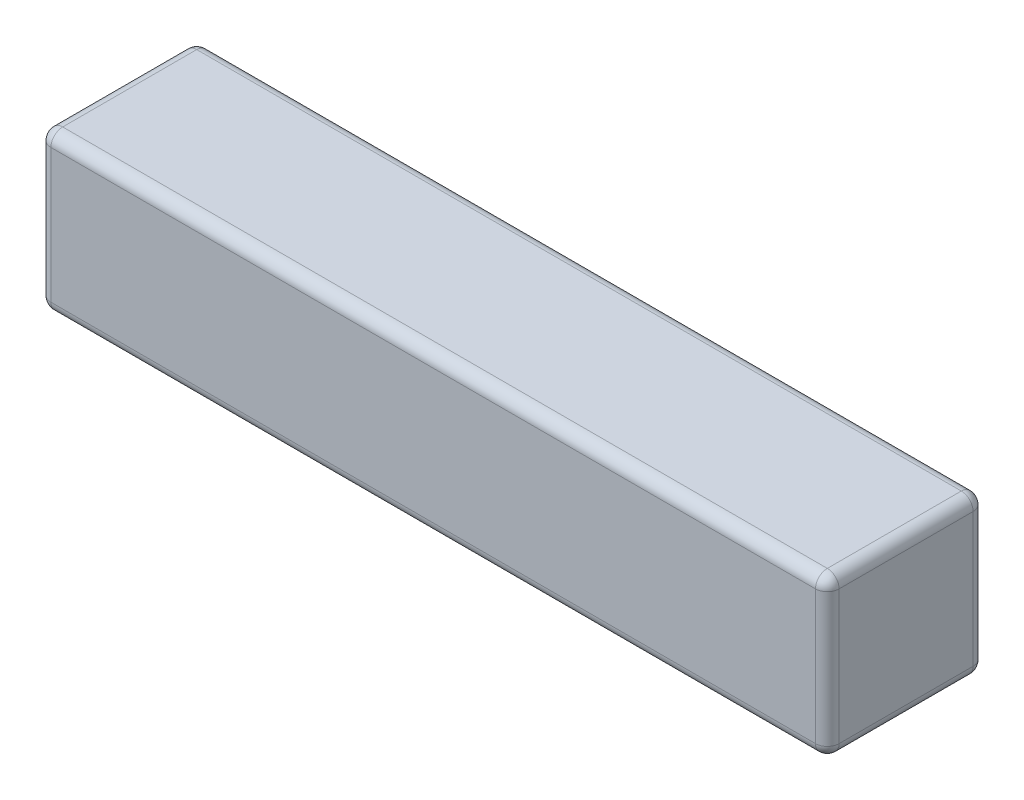
ISO-10303-21;
HEADER;
FILE_DESCRIPTION(('STEP AP214'),'2;1');
FILE_NAME('part.step','',(''),(''),'','','');
FILE_SCHEMA(('AUTOMOTIVE_DESIGN { 1 0 10303 214 1 1 1 1 }'));
ENDSEC;
DATA;
#1=APPLICATION_CONTEXT('core data for automotive mechanical design processes');
#2=APPLICATION_PROTOCOL_DEFINITION('international standard','automotive_design',2000,#1);
#3=PRODUCT_CONTEXT('',#1,'mechanical');
#4=PRODUCT('Part','Part','',(#3));
#5=PRODUCT_RELATED_PRODUCT_CATEGORY('part','',(#4));
#6=PRODUCT_DEFINITION_FORMATION('','',#4);
#7=PRODUCT_DEFINITION_CONTEXT('part definition',#1,'design');
#8=PRODUCT_DEFINITION('design','',#6,#7);
#9=PRODUCT_DEFINITION_SHAPE('','',#8);
#10=(LENGTH_UNIT() NAMED_UNIT(*) SI_UNIT(.MILLI.,.METRE.));
#11=(NAMED_UNIT(*) PLANE_ANGLE_UNIT() SI_UNIT($,.RADIAN.));
#12=(NAMED_UNIT(*) SI_UNIT($,.STERADIAN.) SOLID_ANGLE_UNIT());
#13=UNCERTAINTY_MEASURE_WITH_UNIT(LENGTH_MEASURE(1.E-05),#10,'distance_accuracy_value','');
#14=(GEOMETRIC_REPRESENTATION_CONTEXT(3) GLOBAL_UNCERTAINTY_ASSIGNED_CONTEXT((#13)) GLOBAL_UNIT_ASSIGNED_CONTEXT((#10,
#11,#12)) REPRESENTATION_CONTEXT('',''));
#15=CARTESIAN_POINT('',(0.,0.,0.));
#16=DIRECTION('',(0.,0.,1.));
#17=DIRECTION('',(1.,0.,0.));
#18=AXIS2_PLACEMENT_3D('',#15,#16,#17);
#19=CARTESIAN_POINT('',(4.,-0.15,-3.25423963133641));
#20=DIRECTION('',(-1.,0.,0.));
#21=DIRECTION('',(0.,0.,1.));
#22=AXIS2_PLACEMENT_3D('',#19,#20,#21);
#23=CYLINDRICAL_SURFACE('',#22,0.15);
#24=CARTESIAN_POINT('',(13.85,-0.15,-3.25423963133641));
#25=DIRECTION('',(-1.,0.,0.));
#26=DIRECTION('',(0.,0.,-1.));
#27=AXIS2_PLACEMENT_3D('',#24,#25,#26);
#28=CIRCLE('',#27,0.15);
#29=CARTESIAN_POINT('',(13.85,0.,-3.25423963133641));
#30=VERTEX_POINT('',#29);
#31=CARTESIAN_POINT('',(13.85,-0.15,-3.4042396313364));
#32=VERTEX_POINT('',#31);
#33=EDGE_CURVE('E25',#30,#32,#28,.T.);
#34=ORIENTED_EDGE('',*,*,#33,.T.);
#35=DIRECTION('',(1.,0.,0.));
#36=VECTOR('',#35,1.);
#37=CARTESIAN_POINT('',(14.,-0.15,-3.4042396313364));
#38=LINE('',#37,#36);
#39=CARTESIAN_POINT('',(4.15,-0.15,-3.4042396313364));
#40=VERTEX_POINT('',#39);
#41=EDGE_CURVE('E199',#40,#32,#38,.T.);
#42=ORIENTED_EDGE('',*,*,#41,.F.);
#43=CARTESIAN_POINT('',(4.15,-0.15,-3.25423963133641));
#44=DIRECTION('',(1.,0.,0.));
#45=DIRECTION('',(0.,0.,1.));
#46=AXIS2_PLACEMENT_3D('',#43,#44,#45);
#47=CIRCLE('',#46,0.15);
#48=CARTESIAN_POINT('',(4.15,0.,-3.25423963133641));
#49=VERTEX_POINT('',#48);
#50=EDGE_CURVE('E11',#40,#49,#47,.T.);
#51=ORIENTED_EDGE('',*,*,#50,.T.);
#52=DIRECTION('',(-1.,0.,0.));
#53=VECTOR('',#52,1.);
#54=CARTESIAN_POINT('',(4.,0.,-3.25423963133641));
#55=LINE('',#54,#53);
#56=EDGE_CURVE('E260',#30,#49,#55,.T.);
#57=ORIENTED_EDGE('',*,*,#56,.F.);
#58=EDGE_LOOP('',(#34,#42,#51,#57));
#59=FACE_BOUND('',#58,.T.);
#60=ADVANCED_FACE('F16',(#59),#23,.T.);
#61=CARTESIAN_POINT('',(4.15,-0.15,-3.25423963133641));
#62=DIRECTION('',(0.,1.,0.));
#63=DIRECTION('',(1.,0.,0.));
#64=AXIS2_PLACEMENT_3D('',#61,#62,#63);
#65=SPHERICAL_SURFACE('',#64,0.15);
#66=CARTESIAN_POINT('',(4.15,-0.15,-3.25423963133641));
#67=DIRECTION('',(0.,1.,0.));
#68=DIRECTION('',(0.,0.,1.));
#69=AXIS2_PLACEMENT_3D('',#66,#67,#68);
#70=CIRCLE('',#69,0.15);
#71=CARTESIAN_POINT('',(4.,-0.15,-3.25423963133641));
#72=VERTEX_POINT('',#71);
#73=EDGE_CURVE('E223',#40,#72,#70,.T.);
#74=ORIENTED_EDGE('',*,*,#73,.T.);
#75=CARTESIAN_POINT('',(4.15,-0.15,-3.25423963133641));
#76=DIRECTION('',(0.,0.,-1.));
#77=DIRECTION('',(-1.,0.,0.));
#78=AXIS2_PLACEMENT_3D('',#75,#76,#77);
#79=CIRCLE('',#78,0.15);
#80=EDGE_CURVE('E173',#72,#49,#79,.T.);
#81=ORIENTED_EDGE('',*,*,#80,.T.);
#82=ORIENTED_EDGE('',*,*,#50,.F.);
#83=EDGE_LOOP('',(#74,#81,#82));
#84=FACE_BOUND('',#83,.T.);
#85=ADVANCED_FACE('F18',(#84),#65,.T.);
#86=CARTESIAN_POINT('',(13.85,-0.15,-3.25423963133641));
#87=DIRECTION('',(0.,1.,0.));
#88=DIRECTION('',(1.,0.,0.));
#89=AXIS2_PLACEMENT_3D('',#86,#87,#88);
#90=SPHERICAL_SURFACE('',#89,0.15);
#91=CARTESIAN_POINT('',(13.85,-0.15,-3.25423963133641));
#92=DIRECTION('',(0.,0.,-1.));
#93=DIRECTION('',(-1.,0.,0.));
#94=AXIS2_PLACEMENT_3D('',#91,#92,#93);
#95=CIRCLE('',#94,0.15);
#96=CARTESIAN_POINT('',(14.,-0.15,-3.25423963133641));
#97=VERTEX_POINT('',#96);
#98=EDGE_CURVE('E193',#30,#97,#95,.T.);
#99=ORIENTED_EDGE('',*,*,#98,.T.);
#100=CARTESIAN_POINT('',(13.85,-0.15,-3.25423963133641));
#101=DIRECTION('',(0.,1.,0.));
#102=DIRECTION('',(0.,0.,1.));
#103=AXIS2_PLACEMENT_3D('',#100,#101,#102);
#104=CIRCLE('',#103,0.15);
#105=EDGE_CURVE('E190',#97,#32,#104,.T.);
#106=ORIENTED_EDGE('',*,*,#105,.T.);
#107=ORIENTED_EDGE('',*,*,#33,.F.);
#108=EDGE_LOOP('',(#99,#106,#107));
#109=FACE_BOUND('',#108,.T.);
#110=ADVANCED_FACE('F331',(#109),#90,.T.);
#111=CARTESIAN_POINT('',(4.15,-2.,-3.25423963133641));
#112=DIRECTION('',(0.,1.,0.));
#113=DIRECTION('',(0.,0.,1.));
#114=AXIS2_PLACEMENT_3D('',#111,#112,#113);
#115=CYLINDRICAL_SURFACE('',#114,0.15);
#116=CARTESIAN_POINT('',(4.15,-1.85,-3.25423963133641));
#117=DIRECTION('',(0.,1.,0.));
#118=DIRECTION('',(0.,0.,-1.));
#119=AXIS2_PLACEMENT_3D('',#116,#117,#118);
#120=CIRCLE('',#119,0.15);
#121=CARTESIAN_POINT('',(4.15,-1.85,-3.4042396313364));
#122=VERTEX_POINT('',#121);
#123=CARTESIAN_POINT('',(4.,-1.85,-3.25423963133641));
#124=VERTEX_POINT('',#123);
#125=EDGE_CURVE('E144',#122,#124,#120,.T.);
#126=ORIENTED_EDGE('',*,*,#125,.T.);
#127=DIRECTION('',(0.,-1.,0.));
#128=VECTOR('',#127,1.);
#129=CARTESIAN_POINT('',(4.,-2.,-3.25423963133641));
#130=LINE('',#129,#128);
#131=EDGE_CURVE('E176',#72,#124,#130,.T.);
#132=ORIENTED_EDGE('',*,*,#131,.F.);
#133=ORIENTED_EDGE('',*,*,#73,.F.);
#134=DIRECTION('',(0.,1.,0.));
#135=VECTOR('',#134,1.);
#136=CARTESIAN_POINT('',(4.15,-2.,-3.4042396313364));
#137=LINE('',#136,#135);
#138=EDGE_CURVE('E195',#122,#40,#137,.T.);
#139=ORIENTED_EDGE('',*,*,#138,.F.);
#140=EDGE_LOOP('',(#126,#132,#133,#139));
#141=FACE_BOUND('',#140,.T.);
#142=ADVANCED_FACE('F342',(#141),#115,.T.);
#143=CARTESIAN_POINT('',(4.15,-0.15,-1.4042396313364));
#144=DIRECTION('',(0.,0.,1.));
#145=DIRECTION('',(1.,0.,0.));
#146=AXIS2_PLACEMENT_3D('',#143,#144,#145);
#147=CYLINDRICAL_SURFACE('',#146,0.15);
#148=CARTESIAN_POINT('',(4.15,-0.15,-1.5542396313364));
#149=DIRECTION('',(0.,0.,-1.));
#150=DIRECTION('',(1.,0.,0.));
#151=AXIS2_PLACEMENT_3D('',#148,#149,#150);
#152=CIRCLE('',#151,0.15);
#153=CARTESIAN_POINT('',(4.,-0.15,-1.5542396313364));
#154=VERTEX_POINT('',#153);
#155=CARTESIAN_POINT('',(4.15,0.,-1.5542396313364));
#156=VERTEX_POINT('',#155);
#157=EDGE_CURVE('E38',#154,#156,#152,.T.);
#158=ORIENTED_EDGE('',*,*,#157,.T.);
#159=DIRECTION('',(0.,0.,1.));
#160=VECTOR('',#159,1.);
#161=CARTESIAN_POINT('',(4.15,0.,-1.4042396313364));
#162=LINE('',#161,#160);
#163=EDGE_CURVE('E264',#49,#156,#162,.T.);
#164=ORIENTED_EDGE('',*,*,#163,.F.);
#165=ORIENTED_EDGE('',*,*,#80,.F.);
#166=DIRECTION('',(0.,0.,-1.));
#167=VECTOR('',#166,1.);
#168=CARTESIAN_POINT('',(4.,-0.15,-3.4042396313364));
#169=LINE('',#168,#167);
#170=EDGE_CURVE('E165',#154,#72,#169,.T.);
#171=ORIENTED_EDGE('',*,*,#170,.F.);
#172=EDGE_LOOP('',(#158,#164,#165,#171));
#173=FACE_BOUND('',#172,.T.);
#174=ADVANCED_FACE('F172',(#173),#147,.T.);
#175=CARTESIAN_POINT('',(13.85,-0.15,-1.4042396313364));
#176=DIRECTION('',(0.,0.,-1.));
#177=DIRECTION('',(-1.,0.,0.));
#178=AXIS2_PLACEMENT_3D('',#175,#176,#177);
#179=CYLINDRICAL_SURFACE('',#178,0.15);
#180=CARTESIAN_POINT('',(13.85,-0.15,-1.5542396313364));
#181=DIRECTION('',(0.,0.,-1.));
#182=DIRECTION('',(1.,0.,0.));
#183=AXIS2_PLACEMENT_3D('',#180,#181,#182);
#184=CIRCLE('',#183,0.15);
#185=CARTESIAN_POINT('',(13.85,0.,-1.5542396313364));
#186=VERTEX_POINT('',#185);
#187=CARTESIAN_POINT('',(14.,-0.15,-1.5542396313364));
#188=VERTEX_POINT('',#187);
#189=EDGE_CURVE('E145',#186,#188,#184,.T.);
#190=ORIENTED_EDGE('',*,*,#189,.T.);
#191=DIRECTION('',(0.,0.,1.));
#192=VECTOR('',#191,1.);
#193=CARTESIAN_POINT('',(14.,-0.15,-1.4042396313364));
#194=LINE('',#193,#192);
#195=EDGE_CURVE('E188',#97,#188,#194,.T.);
#196=ORIENTED_EDGE('',*,*,#195,.F.);
#197=ORIENTED_EDGE('',*,*,#98,.F.);
#198=DIRECTION('',(0.,0.,-1.));
#199=VECTOR('',#198,1.);
#200=CARTESIAN_POINT('',(13.85,0.,-1.4042396313364));
#201=LINE('',#200,#199);
#202=EDGE_CURVE('E256',#186,#30,#201,.T.);
#203=ORIENTED_EDGE('',*,*,#202,.F.);
#204=EDGE_LOOP('',(#190,#196,#197,#203));
#205=FACE_BOUND('',#204,.T.);
#206=ADVANCED_FACE('F348',(#205),#179,.T.);
#207=CARTESIAN_POINT('',(13.85,-2.,-3.25423963133641));
#208=DIRECTION('',(0.,1.,0.));
#209=DIRECTION('',(0.,0.,1.));
#210=AXIS2_PLACEMENT_3D('',#207,#208,#209);
#211=CYLINDRICAL_SURFACE('',#210,0.15);
#212=CARTESIAN_POINT('',(13.85,-1.85,-3.25423963133641));
#213=DIRECTION('',(0.,1.,0.));
#214=DIRECTION('',(0.,0.,-1.));
#215=AXIS2_PLACEMENT_3D('',#212,#213,#214);
#216=CIRCLE('',#215,0.15);
#217=CARTESIAN_POINT('',(14.,-1.85,-3.25423963133641));
#218=VERTEX_POINT('',#217);
#219=CARTESIAN_POINT('',(13.85,-1.85,-3.4042396313364));
#220=VERTEX_POINT('',#219);
#221=EDGE_CURVE('E318',#218,#220,#216,.T.);
#222=ORIENTED_EDGE('',*,*,#221,.T.);
#223=DIRECTION('',(0.,-1.,0.));
#224=VECTOR('',#223,1.);
#225=CARTESIAN_POINT('',(13.85,-2.,-3.4042396313364));
#226=LINE('',#225,#224);
#227=EDGE_CURVE('E206',#32,#220,#226,.T.);
#228=ORIENTED_EDGE('',*,*,#227,.F.);
#229=ORIENTED_EDGE('',*,*,#105,.F.);
#230=DIRECTION('',(0.,1.,0.));
#231=VECTOR('',#230,1.);
#232=CARTESIAN_POINT('',(14.,-2.,-3.25423963133641));
#233=LINE('',#232,#231);
#234=EDGE_CURVE('E184',#218,#97,#233,.T.);
#235=ORIENTED_EDGE('',*,*,#234,.F.);
#236=EDGE_LOOP('',(#222,#228,#229,#235));
#237=FACE_BOUND('',#236,.T.);
#238=ADVANCED_FACE('F335',(#237),#211,.T.);
#239=CARTESIAN_POINT('',(4.15,-1.85,-3.25423963133641));
#240=DIRECTION('',(0.,1.,0.));
#241=DIRECTION('',(1.,0.,0.));
#242=AXIS2_PLACEMENT_3D('',#239,#240,#241);
#243=SPHERICAL_SURFACE('',#242,0.15);
#244=CARTESIAN_POINT('',(4.15,-1.85,-3.25423963133641));
#245=DIRECTION('',(-1.,0.,0.));
#246=DIRECTION('',(0.,-1.,0.));
#247=AXIS2_PLACEMENT_3D('',#244,#245,#246);
#248=CIRCLE('',#247,0.15);
#249=CARTESIAN_POINT('',(4.15,-2.,-3.25423963133641));
#250=VERTEX_POINT('',#249);
#251=EDGE_CURVE('E315',#122,#250,#248,.T.);
#252=ORIENTED_EDGE('',*,*,#251,.T.);
#253=CARTESIAN_POINT('',(4.15,-1.85,-3.25423963133641));
#254=DIRECTION('',(0.,0.,-1.));
#255=DIRECTION('',(-1.,0.,0.));
#256=AXIS2_PLACEMENT_3D('',#253,#254,#255);
#257=CIRCLE('',#256,0.15);
#258=EDGE_CURVE('E158',#250,#124,#257,.T.);
#259=ORIENTED_EDGE('',*,*,#258,.T.);
#260=ORIENTED_EDGE('',*,*,#125,.F.);
#261=EDGE_LOOP('',(#252,#259,#260));
#262=FACE_BOUND('',#261,.T.);
#263=ADVANCED_FACE('F365',(#262),#243,.T.);
#264=CARTESIAN_POINT('',(4.15,-0.15,-1.5542396313364));
#265=DIRECTION('',(0.,1.,0.));
#266=DIRECTION('',(1.,0.,0.));
#267=AXIS2_PLACEMENT_3D('',#264,#265,#266);
#268=SPHERICAL_SURFACE('',#267,0.15);
#269=CARTESIAN_POINT('',(4.15,-0.15,-1.5542396313364));
#270=DIRECTION('',(0.,1.,0.));
#271=DIRECTION('',(0.,0.,1.));
#272=AXIS2_PLACEMENT_3D('',#269,#270,#271);
#273=CIRCLE('',#272,0.15);
#274=CARTESIAN_POINT('',(4.15,-0.15,-1.4042396313364));
#275=VERTEX_POINT('',#274);
#276=EDGE_CURVE('E139',#154,#275,#273,.T.);
#277=ORIENTED_EDGE('',*,*,#276,.T.);
#278=CARTESIAN_POINT('',(4.15,-0.15,-1.5542396313364));
#279=DIRECTION('',(-1.,0.,0.));
#280=DIRECTION('',(0.,0.,1.));
#281=AXIS2_PLACEMENT_3D('',#278,#279,#280);
#282=CIRCLE('',#281,0.15);
#283=EDGE_CURVE('E141',#275,#156,#282,.T.);
#284=ORIENTED_EDGE('',*,*,#283,.T.);
#285=ORIENTED_EDGE('',*,*,#157,.F.);
#286=EDGE_LOOP('',(#277,#284,#285));
#287=FACE_BOUND('',#286,.T.);
#288=ADVANCED_FACE('F138',(#287),#268,.T.);
#289=CARTESIAN_POINT('',(13.85,-0.15,-1.5542396313364));
#290=DIRECTION('',(0.,1.,0.));
#291=DIRECTION('',(1.,0.,0.));
#292=AXIS2_PLACEMENT_3D('',#289,#290,#291);
#293=SPHERICAL_SURFACE('',#292,0.15);
#294=CARTESIAN_POINT('',(13.85,-0.15,-1.5542396313364));
#295=DIRECTION('',(1.,0.,0.));
#296=DIRECTION('',(0.,0.,-1.));
#297=AXIS2_PLACEMENT_3D('',#294,#295,#296);
#298=CIRCLE('',#297,0.15);
#299=CARTESIAN_POINT('',(13.85,-0.15,-1.4042396313364));
#300=VERTEX_POINT('',#299);
#301=EDGE_CURVE('E159',#186,#300,#298,.T.);
#302=ORIENTED_EDGE('',*,*,#301,.T.);
#303=CARTESIAN_POINT('',(13.85,-0.15,-1.5542396313364));
#304=DIRECTION('',(0.,1.,0.));
#305=DIRECTION('',(0.,0.,1.));
#306=AXIS2_PLACEMENT_3D('',#303,#304,#305);
#307=CIRCLE('',#306,0.15);
#308=EDGE_CURVE('E300',#300,#188,#307,.T.);
#309=ORIENTED_EDGE('',*,*,#308,.T.);
#310=ORIENTED_EDGE('',*,*,#189,.F.);
#311=EDGE_LOOP('',(#302,#309,#310));
#312=FACE_BOUND('',#311,.T.);
#313=ADVANCED_FACE('F401',(#312),#293,.T.);
#314=CARTESIAN_POINT('',(13.85,-1.85,-3.25423963133641));
#315=DIRECTION('',(0.,1.,0.));
#316=DIRECTION('',(1.,0.,0.));
#317=AXIS2_PLACEMENT_3D('',#314,#315,#316);
#318=SPHERICAL_SURFACE('',#317,0.15);
#319=CARTESIAN_POINT('',(13.85,-1.85,-3.25423963133641));
#320=DIRECTION('',(0.,0.,-1.));
#321=DIRECTION('',(-1.,0.,0.));
#322=AXIS2_PLACEMENT_3D('',#319,#320,#321);
#323=CIRCLE('',#322,0.15);
#324=CARTESIAN_POINT('',(13.85,-2.,-3.25423963133641));
#325=VERTEX_POINT('',#324);
#326=EDGE_CURVE('E296',#218,#325,#323,.T.);
#327=ORIENTED_EDGE('',*,*,#326,.T.);
#328=CARTESIAN_POINT('',(13.85,-1.85,-3.25423963133641));
#329=DIRECTION('',(1.,0.,0.));
#330=DIRECTION('',(0.,0.,-1.));
#331=AXIS2_PLACEMENT_3D('',#328,#329,#330);
#332=CIRCLE('',#331,0.15);
#333=EDGE_CURVE('E311',#325,#220,#332,.T.);
#334=ORIENTED_EDGE('',*,*,#333,.T.);
#335=ORIENTED_EDGE('',*,*,#221,.F.);
#336=EDGE_LOOP('',(#327,#334,#335));
#337=FACE_BOUND('',#336,.T.);
#338=ADVANCED_FACE('F358',(#337),#318,.T.);
#339=CARTESIAN_POINT('',(14.,-1.85,-3.25423963133641));
#340=DIRECTION('',(1.,0.,0.));
#341=DIRECTION('',(0.,0.,-1.));
#342=AXIS2_PLACEMENT_3D('',#339,#340,#341);
#343=CYLINDRICAL_SURFACE('',#342,0.15);
#344=ORIENTED_EDGE('',*,*,#333,.F.);
#345=DIRECTION('',(1.,0.,0.));
#346=VECTOR('',#345,1.);
#347=CARTESIAN_POINT('',(14.,-2.,-3.25423963133641));
#348=LINE('',#347,#346);
#349=EDGE_CURVE('E243',#250,#325,#348,.T.);
#350=ORIENTED_EDGE('',*,*,#349,.F.);
#351=ORIENTED_EDGE('',*,*,#251,.F.);
#352=DIRECTION('',(-1.,0.,0.));
#353=VECTOR('',#352,1.);
#354=CARTESIAN_POINT('',(4.,-1.85,-3.4042396313364));
#355=LINE('',#354,#353);
#356=EDGE_CURVE('E236',#220,#122,#355,.T.);
#357=ORIENTED_EDGE('',*,*,#356,.F.);
#358=EDGE_LOOP('',(#344,#350,#351,#357));
#359=FACE_BOUND('',#358,.T.);
#360=ADVANCED_FACE('F362',(#359),#343,.T.);
#361=CARTESIAN_POINT('',(4.15,-1.85,-3.4042396313364));
#362=DIRECTION('',(0.,0.,-1.));
#363=DIRECTION('',(-1.,0.,0.));
#364=AXIS2_PLACEMENT_3D('',#361,#362,#363);
#365=CYLINDRICAL_SURFACE('',#364,0.15);
#366=CARTESIAN_POINT('',(4.15,-1.85,-1.5542396313364));
#367=DIRECTION('',(0.,0.,-1.));
#368=DIRECTION('',(1.,0.,0.));
#369=AXIS2_PLACEMENT_3D('',#366,#367,#368);
#370=CIRCLE('',#369,0.15);
#371=CARTESIAN_POINT('',(4.15,-2.,-1.5542396313364));
#372=VERTEX_POINT('',#371);
#373=CARTESIAN_POINT('',(4.,-1.85,-1.5542396313364));
#374=VERTEX_POINT('',#373);
#375=EDGE_CURVE('E279',#372,#374,#370,.T.);
#376=ORIENTED_EDGE('',*,*,#375,.T.);
#377=DIRECTION('',(0.,0.,1.));
#378=VECTOR('',#377,1.);
#379=CARTESIAN_POINT('',(4.,-1.85,-1.4042396313364));
#380=LINE('',#379,#378);
#381=EDGE_CURVE('E167',#124,#374,#380,.T.);
#382=ORIENTED_EDGE('',*,*,#381,.F.);
#383=ORIENTED_EDGE('',*,*,#258,.F.);
#384=DIRECTION('',(0.,0.,-1.));
#385=VECTOR('',#384,1.);
#386=CARTESIAN_POINT('',(4.15,-2.,-3.4042396313364));
#387=LINE('',#386,#385);
#388=EDGE_CURVE('E240',#372,#250,#387,.T.);
#389=ORIENTED_EDGE('',*,*,#388,.F.);
#390=EDGE_LOOP('',(#376,#382,#383,#389));
#391=FACE_BOUND('',#390,.T.);
#392=ADVANCED_FACE('F368',(#391),#365,.T.);
#393=CARTESIAN_POINT('',(4.15,-2.,-1.5542396313364));
#394=DIRECTION('',(0.,1.,0.));
#395=DIRECTION('',(0.,0.,1.));
#396=AXIS2_PLACEMENT_3D('',#393,#394,#395);
#397=CYLINDRICAL_SURFACE('',#396,0.15);
#398=CARTESIAN_POINT('',(4.15,-1.85,-1.5542396313364));
#399=DIRECTION('',(0.,1.,0.));
#400=DIRECTION('',(0.,0.,-1.));
#401=AXIS2_PLACEMENT_3D('',#398,#399,#400);
#402=CIRCLE('',#401,0.15);
#403=CARTESIAN_POINT('',(4.15,-1.85,-1.4042396313364));
#404=VERTEX_POINT('',#403);
#405=EDGE_CURVE('E283',#374,#404,#402,.T.);
#406=ORIENTED_EDGE('',*,*,#405,.T.);
#407=DIRECTION('',(0.,-1.,0.));
#408=VECTOR('',#407,1.);
#409=CARTESIAN_POINT('',(4.15,-2.,-1.4042396313364));
#410=LINE('',#409,#408);
#411=EDGE_CURVE('E155',#275,#404,#410,.T.);
#412=ORIENTED_EDGE('',*,*,#411,.F.);
#413=ORIENTED_EDGE('',*,*,#276,.F.);
#414=DIRECTION('',(0.,1.,0.));
#415=VECTOR('',#414,1.);
#416=CARTESIAN_POINT('',(4.,-2.,-1.5542396313364));
#417=LINE('',#416,#415);
#418=EDGE_CURVE('E152',#374,#154,#417,.T.);
#419=ORIENTED_EDGE('',*,*,#418,.F.);
#420=EDGE_LOOP('',(#406,#412,#413,#419));
#421=FACE_BOUND('',#420,.T.);
#422=ADVANCED_FACE('F151',(#421),#397,.T.);
#423=CARTESIAN_POINT('',(4.,-0.15,-1.5542396313364));
#424=DIRECTION('',(1.,0.,0.));
#425=DIRECTION('',(0.,0.,-1.));
#426=AXIS2_PLACEMENT_3D('',#423,#424,#425);
#427=CYLINDRICAL_SURFACE('',#426,0.15);
#428=ORIENTED_EDGE('',*,*,#283,.F.);
#429=DIRECTION('',(-1.,0.,0.));
#430=VECTOR('',#429,1.);
#431=CARTESIAN_POINT('',(4.,-0.15,-1.4042396313364));
#432=LINE('',#431,#430);
#433=EDGE_CURVE('E210',#300,#275,#432,.T.);
#434=ORIENTED_EDGE('',*,*,#433,.F.);
#435=ORIENTED_EDGE('',*,*,#301,.F.);
#436=DIRECTION('',(1.,0.,0.));
#437=VECTOR('',#436,1.);
#438=CARTESIAN_POINT('',(4.,0.,-1.5542396313364));
#439=LINE('',#438,#437);
#440=EDGE_CURVE('E268',#156,#186,#439,.T.);
#441=ORIENTED_EDGE('',*,*,#440,.F.);
#442=EDGE_LOOP('',(#428,#434,#435,#441));
#443=FACE_BOUND('',#442,.T.);
#444=ADVANCED_FACE('F486',(#443),#427,.T.);
#445=CARTESIAN_POINT('',(13.85,-2.,-1.5542396313364));
#446=DIRECTION('',(0.,1.,0.));
#447=DIRECTION('',(0.,0.,1.));
#448=AXIS2_PLACEMENT_3D('',#445,#446,#447);
#449=CYLINDRICAL_SURFACE('',#448,0.15);
#450=CARTESIAN_POINT('',(13.85,-1.85,-1.5542396313364));
#451=DIRECTION('',(0.,1.,0.));
#452=DIRECTION('',(0.,0.,-1.));
#453=AXIS2_PLACEMENT_3D('',#450,#451,#452);
#454=CIRCLE('',#453,0.15);
#455=CARTESIAN_POINT('',(13.85,-1.85,-1.4042396313364));
#456=VERTEX_POINT('',#455);
#457=CARTESIAN_POINT('',(14.,-1.85,-1.5542396313364));
#458=VERTEX_POINT('',#457);
#459=EDGE_CURVE('E288',#456,#458,#454,.T.);
#460=ORIENTED_EDGE('',*,*,#459,.T.);
#461=DIRECTION('',(0.,-1.,0.));
#462=VECTOR('',#461,1.);
#463=CARTESIAN_POINT('',(14.,-2.,-1.5542396313364));
#464=LINE('',#463,#462);
#465=EDGE_CURVE('E200',#188,#458,#464,.T.);
#466=ORIENTED_EDGE('',*,*,#465,.F.);
#467=ORIENTED_EDGE('',*,*,#308,.F.);
#468=DIRECTION('',(0.,1.,0.));
#469=VECTOR('',#468,1.);
#470=CARTESIAN_POINT('',(13.85,-2.,-1.4042396313364));
#471=LINE('',#470,#469);
#472=EDGE_CURVE('E169',#456,#300,#471,.T.);
#473=ORIENTED_EDGE('',*,*,#472,.F.);
#474=EDGE_LOOP('',(#460,#466,#467,#473));
#475=FACE_BOUND('',#474,.T.);
#476=ADVANCED_FACE('F494',(#475),#449,.T.);
#477=CARTESIAN_POINT('',(13.85,-1.85,-1.4042396313364));
#478=DIRECTION('',(0.,0.,1.));
#479=DIRECTION('',(1.,0.,0.));
#480=AXIS2_PLACEMENT_3D('',#477,#478,#479);
#481=CYLINDRICAL_SURFACE('',#480,0.15);
#482=CARTESIAN_POINT('',(13.85,-1.85,-1.5542396313364));
#483=DIRECTION('',(0.,0.,-1.));
#484=DIRECTION('',(1.,0.,0.));
#485=AXIS2_PLACEMENT_3D('',#482,#483,#484);
#486=CIRCLE('',#485,0.15);
#487=CARTESIAN_POINT('',(13.85,-2.,-1.5542396313364));
#488=VERTEX_POINT('',#487);
#489=EDGE_CURVE('E284',#458,#488,#486,.T.);
#490=ORIENTED_EDGE('',*,*,#489,.T.);
#491=DIRECTION('',(0.,0.,1.));
#492=VECTOR('',#491,1.);
#493=CARTESIAN_POINT('',(13.85,-2.,-1.4042396313364));
#494=LINE('',#493,#492);
#495=EDGE_CURVE('E248',#325,#488,#494,.T.);
#496=ORIENTED_EDGE('',*,*,#495,.F.);
#497=ORIENTED_EDGE('',*,*,#326,.F.);
#498=DIRECTION('',(0.,0.,-1.));
#499=VECTOR('',#498,1.);
#500=CARTESIAN_POINT('',(14.,-1.85,-3.4042396313364));
#501=LINE('',#500,#499);
#502=EDGE_CURVE('E189',#458,#218,#501,.T.);
#503=ORIENTED_EDGE('',*,*,#502,.F.);
#504=EDGE_LOOP('',(#490,#496,#497,#503));
#505=FACE_BOUND('',#504,.T.);
#506=ADVANCED_FACE('F355',(#505),#481,.T.);
#507=CARTESIAN_POINT('',(4.15,-1.85,-1.5542396313364));
#508=DIRECTION('',(0.,1.,0.));
#509=DIRECTION('',(1.,0.,0.));
#510=AXIS2_PLACEMENT_3D('',#507,#508,#509);
#511=SPHERICAL_SURFACE('',#510,0.15);
#512=ORIENTED_EDGE('',*,*,#375,.F.);
#513=CARTESIAN_POINT('',(4.15,-1.85,-1.5542396313364));
#514=DIRECTION('',(-1.,0.,0.));
#515=DIRECTION('',(0.,0.,1.));
#516=AXIS2_PLACEMENT_3D('',#513,#514,#515);
#517=CIRCLE('',#516,0.15);
#518=EDGE_CURVE('E276',#372,#404,#517,.T.);
#519=ORIENTED_EDGE('',*,*,#518,.T.);
#520=ORIENTED_EDGE('',*,*,#405,.F.);
#521=EDGE_LOOP('',(#512,#519,#520));
#522=FACE_BOUND('',#521,.T.);
#523=ADVANCED_FACE('F371',(#522),#511,.T.);
#524=CARTESIAN_POINT('',(13.85,-1.85,-1.5542396313364));
#525=DIRECTION('',(0.,1.,0.));
#526=DIRECTION('',(1.,0.,0.));
#527=AXIS2_PLACEMENT_3D('',#524,#525,#526);
#528=SPHERICAL_SURFACE('',#527,0.15);
#529=ORIENTED_EDGE('',*,*,#459,.F.);
#530=CARTESIAN_POINT('',(13.85,-1.85,-1.5542396313364));
#531=DIRECTION('',(1.,0.,0.));
#532=DIRECTION('',(0.,0.,-1.));
#533=AXIS2_PLACEMENT_3D('',#530,#531,#532);
#534=CIRCLE('',#533,0.15);
#535=EDGE_CURVE('E272',#456,#488,#534,.T.);
#536=ORIENTED_EDGE('',*,*,#535,.T.);
#537=ORIENTED_EDGE('',*,*,#489,.F.);
#538=EDGE_LOOP('',(#529,#536,#537));
#539=FACE_BOUND('',#538,.T.);
#540=ADVANCED_FACE('F517',(#539),#528,.T.);
#541=CARTESIAN_POINT('',(4.,-1.85,-1.5542396313364));
#542=DIRECTION('',(-1.,0.,0.));
#543=DIRECTION('',(0.,0.,1.));
#544=AXIS2_PLACEMENT_3D('',#541,#542,#543);
#545=CYLINDRICAL_SURFACE('',#544,0.15);
#546=ORIENTED_EDGE('',*,*,#535,.F.);
#547=DIRECTION('',(1.,0.,0.));
#548=VECTOR('',#547,1.);
#549=CARTESIAN_POINT('',(14.,-1.85,-1.4042396313364));
#550=LINE('',#549,#548);
#551=EDGE_CURVE('E217',#404,#456,#550,.T.);
#552=ORIENTED_EDGE('',*,*,#551,.F.);
#553=ORIENTED_EDGE('',*,*,#518,.F.);
#554=DIRECTION('',(-1.,0.,0.));
#555=VECTOR('',#554,1.);
#556=CARTESIAN_POINT('',(4.,-2.,-1.5542396313364));
#557=LINE('',#556,#555);
#558=EDGE_CURVE('E252',#488,#372,#557,.T.);
#559=ORIENTED_EDGE('',*,*,#558,.F.);
#560=EDGE_LOOP('',(#546,#552,#553,#559));
#561=FACE_BOUND('',#560,.T.);
#562=ADVANCED_FACE('F376',(#561),#545,.T.);
#563=CARTESIAN_POINT('',(4.,0.,-1.4042396313364));
#564=DIRECTION('',(0.,1.,0.));
#565=DIRECTION('',(1.,0.,0.));
#566=AXIS2_PLACEMENT_3D('',#563,#564,#565);
#567=PLANE('',#566);
#568=ORIENTED_EDGE('',*,*,#202,.T.);
#569=ORIENTED_EDGE('',*,*,#56,.T.);
#570=ORIENTED_EDGE('',*,*,#163,.T.);
#571=ORIENTED_EDGE('',*,*,#440,.T.);
#572=EDGE_LOOP('',(#568,#569,#570,#571));
#573=FACE_BOUND('',#572,.T.);
#574=ADVANCED_FACE('F345',(#573),#567,.T.);
#575=CARTESIAN_POINT('',(4.,-2.,-1.4042396313364));
#576=DIRECTION('',(0.,1.,0.));
#577=DIRECTION('',(1.,0.,0.));
#578=AXIS2_PLACEMENT_3D('',#575,#576,#577);
#579=PLANE('',#578);
#580=ORIENTED_EDGE('',*,*,#388,.T.);
#581=ORIENTED_EDGE('',*,*,#349,.T.);
#582=ORIENTED_EDGE('',*,*,#495,.T.);
#583=ORIENTED_EDGE('',*,*,#558,.T.);
#584=EDGE_LOOP('',(#580,#581,#582,#583));
#585=FACE_BOUND('',#584,.T.);
#586=ADVANCED_FACE('F378',(#585),#579,.F.);
#587=CARTESIAN_POINT('',(14.,-2.,-3.4042396313364));
#588=DIRECTION('',(0.,0.,-1.));
#589=DIRECTION('',(0.,-1.,0.));
#590=AXIS2_PLACEMENT_3D('',#587,#588,#589);
#591=PLANE('',#590);
#592=ORIENTED_EDGE('',*,*,#138,.T.);
#593=ORIENTED_EDGE('',*,*,#41,.T.);
#594=ORIENTED_EDGE('',*,*,#227,.T.);
#595=ORIENTED_EDGE('',*,*,#356,.T.);
#596=EDGE_LOOP('',(#592,#593,#594,#595));
#597=FACE_BOUND('',#596,.T.);
#598=ADVANCED_FACE('F337',(#597),#591,.T.);
#599=CARTESIAN_POINT('',(14.,-2.,-1.4042396313364));
#600=DIRECTION('',(1.,0.,0.));
#601=DIRECTION('',(0.,1.,0.));
#602=AXIS2_PLACEMENT_3D('',#599,#600,#601);
#603=PLANE('',#602);
#604=ORIENTED_EDGE('',*,*,#502,.T.);
#605=ORIENTED_EDGE('',*,*,#234,.T.);
#606=ORIENTED_EDGE('',*,*,#195,.T.);
#607=ORIENTED_EDGE('',*,*,#465,.T.);
#608=EDGE_LOOP('',(#604,#605,#606,#607));
#609=FACE_BOUND('',#608,.T.);
#610=ADVANCED_FACE('F350',(#609),#603,.T.);
#611=CARTESIAN_POINT('',(4.,-2.,-1.4042396313364));
#612=DIRECTION('',(0.,0.,1.));
#613=DIRECTION('',(1.,0.,0.));
#614=AXIS2_PLACEMENT_3D('',#611,#612,#613);
#615=PLANE('',#614);
#616=ORIENTED_EDGE('',*,*,#472,.T.);
#617=ORIENTED_EDGE('',*,*,#433,.T.);
#618=ORIENTED_EDGE('',*,*,#411,.T.);
#619=ORIENTED_EDGE('',*,*,#551,.T.);
#620=EDGE_LOOP('',(#616,#617,#618,#619));
#621=FACE_BOUND('',#620,.T.);
#622=ADVANCED_FACE('F657',(#621),#615,.T.);
#623=CARTESIAN_POINT('',(4.,-2.,-3.4042396313364));
#624=DIRECTION('',(-1.,0.,0.));
#625=DIRECTION('',(0.,0.,1.));
#626=AXIS2_PLACEMENT_3D('',#623,#624,#625);
#627=PLANE('',#626);
#628=ORIENTED_EDGE('',*,*,#170,.T.);
#629=ORIENTED_EDGE('',*,*,#131,.T.);
#630=ORIENTED_EDGE('',*,*,#381,.T.);
#631=ORIENTED_EDGE('',*,*,#418,.T.);
#632=EDGE_LOOP('',(#628,#629,#630,#631));
#633=FACE_BOUND('',#632,.T.);
#634=ADVANCED_FACE('F163',(#633),#627,.T.);
#635=CLOSED_SHELL('',(#60,#85,#110,#142,#174,#206,#238,#263,#288,#313,#338,#360,#392,#422,#444,
#476,#506,#523,#540,#562,#574,#586,#598,#610,#622,#634));
#636=MANIFOLD_SOLID_BREP('B1',#635);
#637=ADVANCED_BREP_SHAPE_REPRESENTATION('',(#18,#636),#14);
#638=SHAPE_DEFINITION_REPRESENTATION(#9,#637);
ENDSEC;
END-ISO-10303-21;
